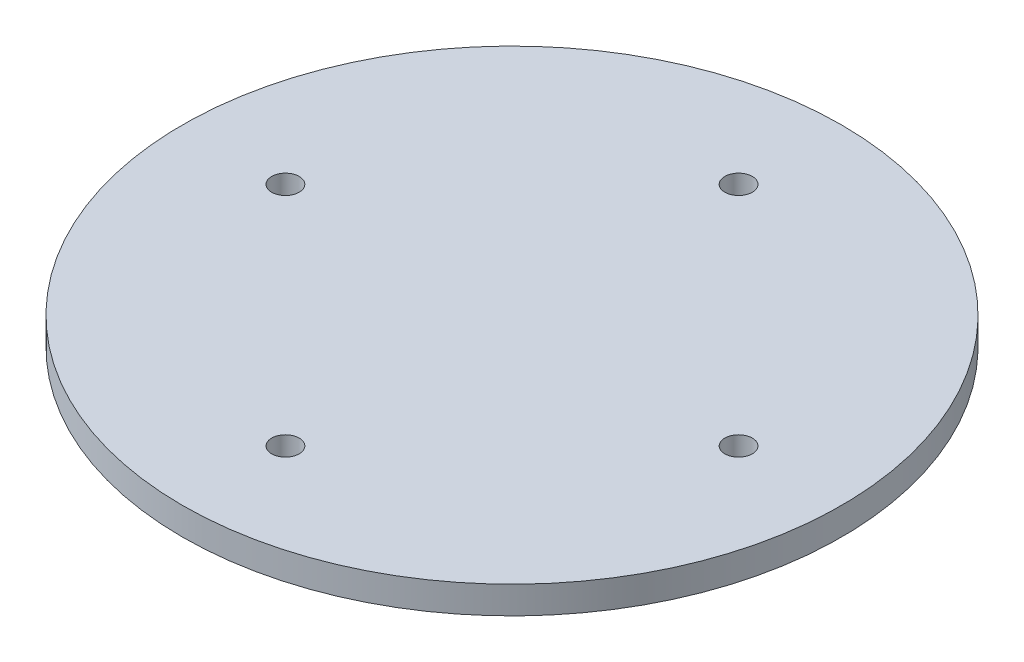
ISO-10303-21;
HEADER;
FILE_DESCRIPTION(('STEP AP214'),'2;1');
FILE_NAME('part.step','',(''),(''),'','','');
FILE_SCHEMA(('AUTOMOTIVE_DESIGN { 1 0 10303 214 1 1 1 1 }'));
ENDSEC;
DATA;
#1=APPLICATION_CONTEXT('core data for automotive mechanical design processes');
#2=APPLICATION_PROTOCOL_DEFINITION('international standard','automotive_design',2000,#1);
#3=PRODUCT_CONTEXT('',#1,'mechanical');
#4=PRODUCT('Part','Part','',(#3));
#5=PRODUCT_RELATED_PRODUCT_CATEGORY('part','',(#4));
#6=PRODUCT_DEFINITION_FORMATION('','',#4);
#7=PRODUCT_DEFINITION_CONTEXT('part definition',#1,'design');
#8=PRODUCT_DEFINITION('design','',#6,#7);
#9=PRODUCT_DEFINITION_SHAPE('','',#8);
#10=(LENGTH_UNIT() NAMED_UNIT(*) SI_UNIT(.MILLI.,.METRE.));
#11=(NAMED_UNIT(*) PLANE_ANGLE_UNIT() SI_UNIT($,.RADIAN.));
#12=(NAMED_UNIT(*) SI_UNIT($,.STERADIAN.) SOLID_ANGLE_UNIT());
#13=UNCERTAINTY_MEASURE_WITH_UNIT(LENGTH_MEASURE(1.E-05),#10,'distance_accuracy_value','');
#14=(GEOMETRIC_REPRESENTATION_CONTEXT(3) GLOBAL_UNCERTAINTY_ASSIGNED_CONTEXT((#13)) GLOBAL_UNIT_ASSIGNED_CONTEXT((#10,
#11,#12)) REPRESENTATION_CONTEXT('',''));
#15=CARTESIAN_POINT('',(0.,0.,0.));
#16=DIRECTION('',(0.,0.,1.));
#17=DIRECTION('',(1.,0.,0.));
#18=AXIS2_PLACEMENT_3D('',#15,#16,#17);
#19=CARTESIAN_POINT('',(0.,5.,0.));
#20=DIRECTION('',(0.,1.,0.));
#21=DIRECTION('',(0.,0.,1.));
#22=AXIS2_PLACEMENT_3D('',#19,#20,#21);
#23=PLANE('',#22);
#24=CARTESIAN_POINT('',(2.33468769191537E-12,5.,41.25));
#25=DIRECTION('',(0.,1.,0.));
#26=DIRECTION('',(0.,0.,1.));
#27=AXIS2_PLACEMENT_3D('',#24,#25,#26);
#28=CIRCLE('',#27,2.50000000000251);
#29=CARTESIAN_POINT('',(2.33468769191537E-12,5.,43.7500000000025));
#30=VERTEX_POINT('',#29);
#31=EDGE_CURVE('E53',#30,#30,#28,.T.);
#32=ORIENTED_EDGE('',*,*,#31,.F.);
#33=EDGE_LOOP('',(#32));
#34=FACE_BOUND('',#33,.T.);
#35=CARTESIAN_POINT('',(0.,5.,-41.25));
#36=DIRECTION('',(0.,1.,0.));
#37=DIRECTION('',(0.,0.,1.));
#38=AXIS2_PLACEMENT_3D('',#35,#36,#37);
#39=CIRCLE('',#38,2.5);
#40=CARTESIAN_POINT('',(0.,5.,-38.75));
#41=VERTEX_POINT('',#40);
#42=EDGE_CURVE('E42',#41,#41,#39,.T.);
#43=ORIENTED_EDGE('',*,*,#42,.F.);
#44=EDGE_LOOP('',(#43));
#45=FACE_BOUND('',#44,.T.);
#46=CARTESIAN_POINT('',(0.,5.,0.));
#47=DIRECTION('',(0.,1.,0.));
#48=DIRECTION('',(0.,0.,1.));
#49=AXIS2_PLACEMENT_3D('',#46,#47,#48);
#50=CIRCLE('',#49,60.);
#51=CARTESIAN_POINT('',(0.,5.,60.));
#52=VERTEX_POINT('',#51);
#53=EDGE_CURVE('E10',#52,#52,#50,.T.);
#54=ORIENTED_EDGE('',*,*,#53,.T.);
#55=EDGE_LOOP('',(#54));
#56=FACE_BOUND('',#55,.T.);
#57=CARTESIAN_POINT('',(41.2500000000012,5.,-1.16734384595768E-12));
#58=DIRECTION('',(0.,1.,0.));
#59=DIRECTION('',(0.,0.,1.));
#60=AXIS2_PLACEMENT_3D('',#57,#58,#59);
#61=CIRCLE('',#60,2.50000000000092);
#62=CARTESIAN_POINT('',(41.2500000000012,5.,2.49999999999975));
#63=VERTEX_POINT('',#62);
#64=EDGE_CURVE('E47',#63,#63,#61,.T.);
#65=ORIENTED_EDGE('',*,*,#64,.F.);
#66=EDGE_LOOP('',(#65));
#67=FACE_BOUND('',#66,.T.);
#68=CARTESIAN_POINT('',(-41.2499999999988,5.,1.17239551400417E-12));
#69=DIRECTION('',(0.,1.,0.));
#70=DIRECTION('',(0.,0.,1.));
#71=AXIS2_PLACEMENT_3D('',#68,#69,#70);
#72=CIRCLE('',#71,2.50000000000187);
#73=CARTESIAN_POINT('',(-41.2499999999988,5.,2.50000000000305));
#74=VERTEX_POINT('',#73);
#75=EDGE_CURVE('E59',#74,#74,#72,.T.);
#76=ORIENTED_EDGE('',*,*,#75,.F.);
#77=EDGE_LOOP('',(#76));
#78=FACE_BOUND('',#77,.T.);
#79=ADVANCED_FACE('F31',(#34,#45,#56,#67,#78),#23,.T.);
#80=CARTESIAN_POINT('',(0.,0.,0.));
#81=DIRECTION('',(0.,1.,0.));
#82=DIRECTION('',(0.,0.,1.));
#83=AXIS2_PLACEMENT_3D('',#80,#81,#82);
#84=PLANE('',#83);
#85=CARTESIAN_POINT('',(0.,0.,0.));
#86=DIRECTION('',(0.,1.,0.));
#87=DIRECTION('',(0.,0.,1.));
#88=AXIS2_PLACEMENT_3D('',#85,#86,#87);
#89=CIRCLE('',#88,60.);
#90=CARTESIAN_POINT('',(0.,0.,60.));
#91=VERTEX_POINT('',#90);
#92=EDGE_CURVE('E35',#91,#91,#89,.T.);
#93=ORIENTED_EDGE('',*,*,#92,.F.);
#94=EDGE_LOOP('',(#93));
#95=FACE_BOUND('',#94,.T.);
#96=CARTESIAN_POINT('',(0.,0.,-41.25));
#97=DIRECTION('',(0.,1.,0.));
#98=DIRECTION('',(0.,0.,1.));
#99=AXIS2_PLACEMENT_3D('',#96,#97,#98);
#100=CIRCLE('',#99,2.5);
#101=CARTESIAN_POINT('',(0.,0.,-38.75));
#102=VERTEX_POINT('',#101);
#103=EDGE_CURVE('E44',#102,#102,#100,.T.);
#104=ORIENTED_EDGE('',*,*,#103,.T.);
#105=EDGE_LOOP('',(#104));
#106=FACE_BOUND('',#105,.T.);
#107=CARTESIAN_POINT('',(41.2500000000012,0.,-1.16734384595768E-12));
#108=DIRECTION('',(0.,1.,0.));
#109=DIRECTION('',(0.,0.,1.));
#110=AXIS2_PLACEMENT_3D('',#107,#108,#109);
#111=CIRCLE('',#110,2.50000000000092);
#112=CARTESIAN_POINT('',(41.2500000000012,0.,2.49999999999975));
#113=VERTEX_POINT('',#112);
#114=EDGE_CURVE('E50',#113,#113,#111,.T.);
#115=ORIENTED_EDGE('',*,*,#114,.T.);
#116=EDGE_LOOP('',(#115));
#117=FACE_BOUND('',#116,.T.);
#118=CARTESIAN_POINT('',(2.33468769191537E-12,0.,41.25));
#119=DIRECTION('',(0.,1.,0.));
#120=DIRECTION('',(0.,0.,1.));
#121=AXIS2_PLACEMENT_3D('',#118,#119,#120);
#122=CIRCLE('',#121,2.50000000000251);
#123=CARTESIAN_POINT('',(2.33468769191537E-12,0.,43.7500000000025));
#124=VERTEX_POINT('',#123);
#125=EDGE_CURVE('E56',#124,#124,#122,.T.);
#126=ORIENTED_EDGE('',*,*,#125,.T.);
#127=EDGE_LOOP('',(#126));
#128=FACE_BOUND('',#127,.T.);
#129=CARTESIAN_POINT('',(-41.2499999999988,0.,1.17239551400417E-12));
#130=DIRECTION('',(0.,1.,0.));
#131=DIRECTION('',(0.,0.,1.));
#132=AXIS2_PLACEMENT_3D('',#129,#130,#131);
#133=CIRCLE('',#132,2.50000000000187);
#134=CARTESIAN_POINT('',(-41.2499999999988,0.,2.50000000000305));
#135=VERTEX_POINT('',#134);
#136=EDGE_CURVE('E62',#135,#135,#133,.T.);
#137=ORIENTED_EDGE('',*,*,#136,.T.);
#138=EDGE_LOOP('',(#137));
#139=FACE_BOUND('',#138,.T.);
#140=ADVANCED_FACE('F72',(#95,#106,#117,#128,#139),#84,.F.);
#141=CARTESIAN_POINT('',(0.,5.,0.));
#142=DIRECTION('',(0.,-1.,0.));
#143=DIRECTION('',(0.,0.,-1.));
#144=AXIS2_PLACEMENT_3D('',#141,#142,#143);
#145=CYLINDRICAL_SURFACE('',#144,60.);
#146=ORIENTED_EDGE('',*,*,#53,.F.);
#147=EDGE_LOOP('',(#146));
#148=FACE_BOUND('',#147,.T.);
#149=ORIENTED_EDGE('',*,*,#92,.T.);
#150=EDGE_LOOP('',(#149));
#151=FACE_BOUND('',#150,.T.);
#152=ADVANCED_FACE('F33',(#148,#151),#145,.T.);
#153=CARTESIAN_POINT('',(0.,5.,-41.25));
#154=DIRECTION('',(0.,-1.,0.));
#155=DIRECTION('',(0.,0.,-1.));
#156=AXIS2_PLACEMENT_3D('',#153,#154,#155);
#157=CYLINDRICAL_SURFACE('',#156,2.5);
#158=ORIENTED_EDGE('',*,*,#42,.T.);
#159=EDGE_LOOP('',(#158));
#160=FACE_BOUND('',#159,.T.);
#161=ORIENTED_EDGE('',*,*,#103,.F.);
#162=EDGE_LOOP('',(#161));
#163=FACE_BOUND('',#162,.T.);
#164=ADVANCED_FACE('F82',(#160,#163),#157,.F.);
#165=CARTESIAN_POINT('',(41.2500000000012,5.,-1.16734384595768E-12));
#166=DIRECTION('',(0.,-1.,0.));
#167=DIRECTION('',(0.,0.,-1.));
#168=AXIS2_PLACEMENT_3D('',#165,#166,#167);
#169=CYLINDRICAL_SURFACE('',#168,2.50000000000092);
#170=ORIENTED_EDGE('',*,*,#64,.T.);
#171=EDGE_LOOP('',(#170));
#172=FACE_BOUND('',#171,.T.);
#173=ORIENTED_EDGE('',*,*,#114,.F.);
#174=EDGE_LOOP('',(#173));
#175=FACE_BOUND('',#174,.T.);
#176=ADVANCED_FACE('F85',(#172,#175),#169,.F.);
#177=CARTESIAN_POINT('',(2.33468769191537E-12,5.,41.25));
#178=DIRECTION('',(0.,-1.,0.));
#179=DIRECTION('',(0.,0.,-1.));
#180=AXIS2_PLACEMENT_3D('',#177,#178,#179);
#181=CYLINDRICAL_SURFACE('',#180,2.50000000000251);
#182=ORIENTED_EDGE('',*,*,#31,.T.);
#183=EDGE_LOOP('',(#182));
#184=FACE_BOUND('',#183,.T.);
#185=ORIENTED_EDGE('',*,*,#125,.F.);
#186=EDGE_LOOP('',(#185));
#187=FACE_BOUND('',#186,.T.);
#188=ADVANCED_FACE('F89',(#184,#187),#181,.F.);
#189=CARTESIAN_POINT('',(-41.2499999999988,5.,1.17239551400417E-12));
#190=DIRECTION('',(0.,-1.,0.));
#191=DIRECTION('',(0.,0.,-1.));
#192=AXIS2_PLACEMENT_3D('',#189,#190,#191);
#193=CYLINDRICAL_SURFACE('',#192,2.50000000000187);
#194=ORIENTED_EDGE('',*,*,#75,.T.);
#195=EDGE_LOOP('',(#194));
#196=FACE_BOUND('',#195,.T.);
#197=ORIENTED_EDGE('',*,*,#136,.F.);
#198=EDGE_LOOP('',(#197));
#199=FACE_BOUND('',#198,.T.);
#200=ADVANCED_FACE('F68',(#196,#199),#193,.F.);
#201=CLOSED_SHELL('',(#79,#140,#152,#164,#176,#188,#200));
#202=MANIFOLD_SOLID_BREP('B2',#201);
#203=ADVANCED_BREP_SHAPE_REPRESENTATION('',(#18,#202),#14);
#204=SHAPE_DEFINITION_REPRESENTATION(#9,#203);
ENDSEC;
END-ISO-10303-21;
